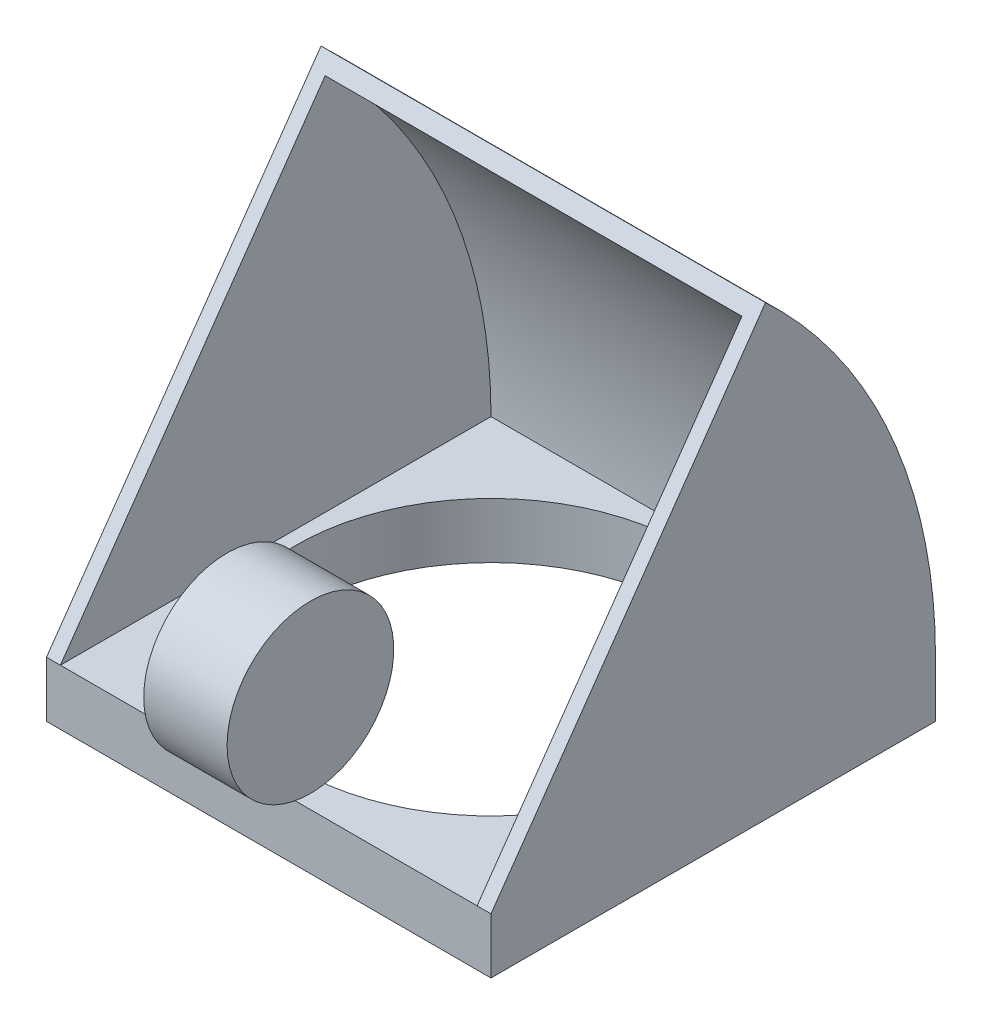
ISO-10303-21;
HEADER;
FILE_DESCRIPTION(('STEP AP214'),'2;1');
FILE_NAME('part.step','',(''),(''),'','','');
FILE_SCHEMA(('AUTOMOTIVE_DESIGN { 1 0 10303 214 1 1 1 1 }'));
ENDSEC;
DATA;
#1=APPLICATION_CONTEXT('core data for automotive mechanical design processes');
#2=APPLICATION_PROTOCOL_DEFINITION('international standard','automotive_design',2000,#1);
#3=PRODUCT_CONTEXT('',#1,'mechanical');
#4=PRODUCT('Part','Part','',(#3));
#5=PRODUCT_RELATED_PRODUCT_CATEGORY('part','',(#4));
#6=PRODUCT_DEFINITION_FORMATION('','',#4);
#7=PRODUCT_DEFINITION_CONTEXT('part definition',#1,'design');
#8=PRODUCT_DEFINITION('design','',#6,#7);
#9=PRODUCT_DEFINITION_SHAPE('','',#8);
#10=(LENGTH_UNIT() NAMED_UNIT(*) SI_UNIT(.MILLI.,.METRE.));
#11=(NAMED_UNIT(*) PLANE_ANGLE_UNIT() SI_UNIT($,.RADIAN.));
#12=(NAMED_UNIT(*) SI_UNIT($,.STERADIAN.) SOLID_ANGLE_UNIT());
#13=UNCERTAINTY_MEASURE_WITH_UNIT(LENGTH_MEASURE(1.E-05),#10,'distance_accuracy_value','');
#14=(GEOMETRIC_REPRESENTATION_CONTEXT(3) GLOBAL_UNCERTAINTY_ASSIGNED_CONTEXT((#13)) GLOBAL_UNIT_ASSIGNED_CONTEXT((#10,
#11,#12)) REPRESENTATION_CONTEXT('',''));
#15=CARTESIAN_POINT('',(0.,0.,0.));
#16=DIRECTION('',(0.,0.,1.));
#17=DIRECTION('',(1.,0.,0.));
#18=AXIS2_PLACEMENT_3D('',#15,#16,#17);
#19=CARTESIAN_POINT('',(19.05,69.85,101.6));
#20=DIRECTION('',(-1.,0.,0.));
#21=DIRECTION('',(0.,0.,1.));
#22=AXIS2_PLACEMENT_3D('',#19,#20,#21);
#23=CYLINDRICAL_SURFACE('',#22,38.1);
#24=CARTESIAN_POINT('',(19.05,69.85,101.6));
#25=DIRECTION('',(1.,0.,0.));
#26=DIRECTION('',(0.,0.,-1.));
#27=AXIS2_PLACEMENT_3D('',#24,#25,#26);
#28=CIRCLE('',#27,38.1);
#29=CARTESIAN_POINT('',(19.05,69.85,139.7));
#30=VERTEX_POINT('',#29);
#31=EDGE_CURVE('E11',#30,#30,#28,.T.);
#32=CARTESIAN_POINT('',(-19.05,69.85,101.6));
#33=DIRECTION('',(1.,0.,0.));
#34=DIRECTION('',(0.,0.,-1.));
#35=AXIS2_PLACEMENT_3D('',#32,#33,#34);
#36=CIRCLE('',#35,38.1);
#37=CARTESIAN_POINT('',(-19.05,69.85,139.7));
#38=VERTEX_POINT('',#37);
#39=EDGE_CURVE('E65',#38,#38,#36,.T.);
#40=CARTESIAN_POINT('',(19.05,69.85,139.7));
#41=CARTESIAN_POINT('',(18.653125,69.85,139.7));
#42=CARTESIAN_POINT('',(18.25625,69.85,139.7));
#43=CARTESIAN_POINT('',(17.4625,69.85,139.7));
#44=CARTESIAN_POINT('',(17.065625,69.85,139.7));
#45=CARTESIAN_POINT('',(16.271875,69.85,139.7));
#46=CARTESIAN_POINT('',(15.875,69.85,139.7));
#47=CARTESIAN_POINT('',(15.08125,69.85,139.7));
#48=CARTESIAN_POINT('',(14.684375,69.85,139.7));
#49=CARTESIAN_POINT('',(13.890625,69.85,139.7));
#50=CARTESIAN_POINT('',(13.49375,69.85,139.7));
#51=CARTESIAN_POINT('',(12.7,69.85,139.7));
#52=CARTESIAN_POINT('',(12.303125,69.85,139.7));
#53=CARTESIAN_POINT('',(11.509375,69.85,139.7));
#54=CARTESIAN_POINT('',(11.1125,69.85,139.7));
#55=CARTESIAN_POINT('',(10.31875,69.85,139.7));
#56=CARTESIAN_POINT('',(9.921875,69.85,139.7));
#57=CARTESIAN_POINT('',(9.128125,69.85,139.7));
#58=CARTESIAN_POINT('',(8.73125,69.85,139.7));
#59=CARTESIAN_POINT('',(7.9375,69.85,139.7));
#60=CARTESIAN_POINT('',(7.540625,69.85,139.7));
#61=CARTESIAN_POINT('',(6.746875,69.85,139.7));
#62=CARTESIAN_POINT('',(6.35,69.85,139.7));
#63=CARTESIAN_POINT('',(5.55625,69.85,139.7));
#64=CARTESIAN_POINT('',(5.159375,69.85,139.7));
#65=CARTESIAN_POINT('',(4.365625,69.85,139.7));
#66=CARTESIAN_POINT('',(3.96875,69.85,139.7));
#67=CARTESIAN_POINT('',(3.175,69.85,139.7));
#68=CARTESIAN_POINT('',(2.778125,69.85,139.7));
#69=CARTESIAN_POINT('',(1.984375,69.85,139.7));
#70=CARTESIAN_POINT('',(1.5875,69.85,139.7));
#71=CARTESIAN_POINT('',(0.79375,69.85,139.7));
#72=CARTESIAN_POINT('',(0.396875,69.85,139.7));
#73=CARTESIAN_POINT('',(-0.396875,69.85,139.7));
#74=CARTESIAN_POINT('',(-0.79375,69.85,139.7));
#75=CARTESIAN_POINT('',(-1.5875,69.85,139.7));
#76=CARTESIAN_POINT('',(-1.984375,69.85,139.7));
#77=CARTESIAN_POINT('',(-2.778125,69.85,139.7));
#78=CARTESIAN_POINT('',(-3.175,69.85,139.7));
#79=CARTESIAN_POINT('',(-3.96875,69.85,139.7));
#80=CARTESIAN_POINT('',(-4.365625,69.85,139.7));
#81=CARTESIAN_POINT('',(-5.159375,69.85,139.7));
#82=CARTESIAN_POINT('',(-5.55625,69.85,139.7));
#83=CARTESIAN_POINT('',(-6.35,69.85,139.7));
#84=CARTESIAN_POINT('',(-6.746875,69.85,139.7));
#85=CARTESIAN_POINT('',(-7.540625,69.85,139.7));
#86=CARTESIAN_POINT('',(-7.9375,69.85,139.7));
#87=CARTESIAN_POINT('',(-8.73125,69.85,139.7));
#88=CARTESIAN_POINT('',(-9.128125,69.85,139.7));
#89=CARTESIAN_POINT('',(-9.921875,69.85,139.7));
#90=CARTESIAN_POINT('',(-10.31875,69.85,139.7));
#91=CARTESIAN_POINT('',(-11.1125,69.85,139.7));
#92=CARTESIAN_POINT('',(-11.509375,69.85,139.7));
#93=CARTESIAN_POINT('',(-12.303125,69.85,139.7));
#94=CARTESIAN_POINT('',(-12.7,69.85,139.7));
#95=CARTESIAN_POINT('',(-13.49375,69.85,139.7));
#96=CARTESIAN_POINT('',(-13.890625,69.85,139.7));
#97=CARTESIAN_POINT('',(-14.684375,69.85,139.7));
#98=CARTESIAN_POINT('',(-15.08125,69.85,139.7));
#99=CARTESIAN_POINT('',(-15.875,69.85,139.7));
#100=CARTESIAN_POINT('',(-16.271875,69.85,139.7));
#101=CARTESIAN_POINT('',(-17.065625,69.85,139.7));
#102=CARTESIAN_POINT('',(-17.4625,69.85,139.7));
#103=CARTESIAN_POINT('',(-18.25625,69.85,139.7));
#104=CARTESIAN_POINT('',(-18.653125,69.85,139.7));
#105=CARTESIAN_POINT('',(-19.05,69.85,139.7));
#106=B_SPLINE_CURVE_WITH_KNOTS('',3,(#40,#41,#42,#43,#44,#45,#46,#47,#48,#49,#50,#51,#52,#53,
#54,#55,#56,#57,#58,#59,#60,#61,#62,#63,#64,#65,#66,#67,#68,#69,#70,#71,#72,#73,#74,#75,#76,#77,
#78,#79,#80,#81,#82,#83,#84,#85,#86,#87,#88,#89,#90,#91,#92,#93,#94,#95,#96,#97,#98,#99,#100,
#101,#102,#103,#104,#105),.UNSPECIFIED.,.F.,.F.,(4,2,2,2,2,2,2,2,2,2,2,2,2,2,2,2,2,2,2,2,2,2,2,
2,2,2,2,2,2,2,2,2,4),(0.,1.190625,2.38125,3.571875,4.7625,5.953125,7.14375,8.334375,9.525,
10.715625,11.90625,13.096875,14.2875,15.478125,16.66875,17.859375,19.05,20.240625,21.43125,
22.621875,23.8125,25.003125,26.19375,27.384375,28.575,29.765625,30.95625,32.146875,33.3375,
34.528125,35.71875,36.909375,38.1),.UNSPECIFIED.);
#107=EDGE_CURVE('BSEAM62',#30,#38,#106,.T.);
#108=ORIENTED_EDGE('',*,*,#31,.F.);
#109=ORIENTED_EDGE('',*,*,#39,.T.);
#110=ORIENTED_EDGE('',*,*,#107,.T.);
#111=ORIENTED_EDGE('',*,*,#107,.F.);
#112=EDGE_LOOP('',(#108,#110,#109,#111));
#113=FACE_BOUND('',#112,.T.);
#114=ADVANCED_FACE('F62',(#113),#23,.T.);
#115=CARTESIAN_POINT('',(19.05,0.,0.));
#116=DIRECTION('',(1.,0.,0.));
#117=DIRECTION('',(0.,0.,-1.));
#118=AXIS2_PLACEMENT_3D('',#115,#116,#117);
#119=PLANE('',#118);
#120=ORIENTED_EDGE('',*,*,#31,.T.);
#121=EDGE_LOOP('',(#120));
#122=FACE_BOUND('',#121,.T.);
#123=ADVANCED_FACE('F77',(#122),#119,.T.);
#124=CARTESIAN_POINT('',(-19.05,0.,0.));
#125=DIRECTION('',(1.,0.,0.));
#126=DIRECTION('',(0.,0.,-1.));
#127=AXIS2_PLACEMENT_3D('',#124,#125,#126);
#128=PLANE('',#127);
#129=ORIENTED_EDGE('',*,*,#39,.F.);
#130=EDGE_LOOP('',(#129));
#131=FACE_BOUND('',#130,.T.);
#132=ADVANCED_FACE('F75',(#131),#128,.F.);
#133=CLOSED_SHELL('',(#114,#123,#132));
#134=MANIFOLD_SOLID_BREP('B2',#133);
#135=CARTESIAN_POINT('',(0.,0.,0.));
#136=DIRECTION('',(0.,1.,0.));
#137=DIRECTION('',(0.,0.,1.));
#138=AXIS2_PLACEMENT_3D('',#135,#136,#137);
#139=PLANE('',#138);
#140=DIRECTION('',(0.,0.,-1.));
#141=VECTOR('',#140,1.);
#142=CARTESIAN_POINT('',(101.6,0.,-101.6));
#143=LINE('',#142,#141);
#144=CARTESIAN_POINT('',(101.6,0.,101.6));
#145=VERTEX_POINT('',#144);
#146=CARTESIAN_POINT('',(101.6,0.,-101.6));
#147=VERTEX_POINT('',#146);
#148=EDGE_CURVE('E268',#145,#147,#143,.T.);
#149=ORIENTED_EDGE('',*,*,#148,.F.);
#150=DIRECTION('',(1.,0.,0.));
#151=VECTOR('',#150,1.);
#152=CARTESIAN_POINT('',(-101.6,0.,101.6));
#153=LINE('',#152,#151);
#154=CARTESIAN_POINT('',(-101.6,0.,101.6));
#155=VERTEX_POINT('',#154);
#156=EDGE_CURVE('E173',#155,#145,#153,.T.);
#157=ORIENTED_EDGE('',*,*,#156,.F.);
#158=DIRECTION('',(0.,0.,1.));
#159=VECTOR('',#158,1.);
#160=CARTESIAN_POINT('',(-101.6,0.,-101.6));
#161=LINE('',#160,#159);
#162=CARTESIAN_POINT('',(-101.6,0.,-101.6));
#163=VERTEX_POINT('',#162);
#164=EDGE_CURVE('E283',#163,#155,#161,.T.);
#165=ORIENTED_EDGE('',*,*,#164,.F.);
#166=DIRECTION('',(-1.,0.,0.));
#167=VECTOR('',#166,1.);
#168=CARTESIAN_POINT('',(-101.6,0.,-101.6));
#169=LINE('',#168,#167);
#170=EDGE_CURVE('E280',#147,#163,#169,.T.);
#171=ORIENTED_EDGE('',*,*,#170,.F.);
#172=EDGE_LOOP('',(#149,#157,#165,#171));
#173=FACE_BOUND('',#172,.T.);
#174=CARTESIAN_POINT('',(0.,0.,0.));
#175=DIRECTION('',(0.,1.,0.));
#176=DIRECTION('',(0.,0.,1.));
#177=AXIS2_PLACEMENT_3D('',#174,#175,#176);
#178=CIRCLE('',#177,88.9);
#179=CARTESIAN_POINT('',(0.,0.,88.9));
#180=VERTEX_POINT('',#179);
#181=EDGE_CURVE('E261',#180,#180,#178,.T.);
#182=ORIENTED_EDGE('',*,*,#181,.T.);
#183=EDGE_LOOP('',(#182));
#184=FACE_BOUND('',#183,.T.);
#185=ADVANCED_FACE('F128',(#173,#184),#139,.F.);
#186=CARTESIAN_POINT('',(101.6,25.4,-101.6));
#187=DIRECTION('',(-1.,0.,0.));
#188=DIRECTION('',(0.,0.,1.));
#189=AXIS2_PLACEMENT_3D('',#186,#187,#188);
#190=PLANE('',#189);
#191=ORIENTED_EDGE('',*,*,#148,.T.);
#192=DIRECTION('',(0.,-1.,0.));
#193=VECTOR('',#192,1.);
#194=CARTESIAN_POINT('',(101.6,25.4,-101.6));
#195=LINE('',#194,#193);
#196=CARTESIAN_POINT('',(101.6,25.4,-101.6));
#197=VERTEX_POINT('',#196);
#198=EDGE_CURVE('E296',#197,#147,#195,.T.);
#199=ORIENTED_EDGE('',*,*,#198,.F.);
#200=CARTESIAN_POINT('',(101.6,25.4,143.933333333333));
#201=DIRECTION('',(1.,0.,0.));
#202=DIRECTION('',(0.,0.,-1.));
#203=AXIS2_PLACEMENT_3D('',#200,#201,#202);
#204=CIRCLE('',#203,245.533333333333);
#205=CARTESIAN_POINT('',(101.6,204.62292697686,-23.8932444892067));
#206=VERTEX_POINT('',#205);
#207=EDGE_CURVE('E248',#197,#206,#204,.T.);
#208=ORIENTED_EDGE('',*,*,#207,.T.);
#209=DIRECTION('',(0.,-0.819152044288989,0.57357643635105));
#210=VECTOR('',#209,1.);
#211=CARTESIAN_POINT('',(101.6,25.4,101.6));
#212=LINE('',#211,#210);
#213=CARTESIAN_POINT('',(101.6,25.4,101.6));
#214=VERTEX_POINT('',#213);
#215=EDGE_CURVE('E252',#206,#214,#212,.T.);
#216=ORIENTED_EDGE('',*,*,#215,.T.);
#217=DIRECTION('',(0.,-1.,0.));
#218=VECTOR('',#217,1.);
#219=CARTESIAN_POINT('',(101.6,25.4,101.6));
#220=LINE('',#219,#218);
#221=EDGE_CURVE('E276',#214,#145,#220,.T.);
#222=ORIENTED_EDGE('',*,*,#221,.T.);
#223=EDGE_LOOP('',(#191,#199,#208,#216,#222));
#224=FACE_BOUND('',#223,.T.);
#225=ADVANCED_FACE('F130',(#224),#190,.F.);
#226=CARTESIAN_POINT('',(-101.6,25.4,-101.6));
#227=DIRECTION('',(0.,0.,1.));
#228=DIRECTION('',(1.,0.,0.));
#229=AXIS2_PLACEMENT_3D('',#226,#227,#228);
#230=PLANE('',#229);
#231=ORIENTED_EDGE('',*,*,#170,.T.);
#232=DIRECTION('',(0.,-1.,0.));
#233=VECTOR('',#232,1.);
#234=CARTESIAN_POINT('',(-101.6,25.4,-101.6));
#235=LINE('',#234,#233);
#236=CARTESIAN_POINT('',(-101.6,25.4,-101.6));
#237=VERTEX_POINT('',#236);
#238=EDGE_CURVE('E292',#237,#163,#235,.T.);
#239=ORIENTED_EDGE('',*,*,#238,.F.);
#240=DIRECTION('',(-1.,0.,0.));
#241=VECTOR('',#240,1.);
#242=CARTESIAN_POINT('',(-101.6,25.4,-101.6));
#243=LINE('',#242,#241);
#244=EDGE_CURVE('E179',#197,#237,#243,.T.);
#245=ORIENTED_EDGE('',*,*,#244,.F.);
#246=ORIENTED_EDGE('',*,*,#198,.T.);
#247=EDGE_LOOP('',(#231,#239,#245,#246));
#248=FACE_BOUND('',#247,.T.);
#249=ADVANCED_FACE('F341',(#248),#230,.F.);
#250=CARTESIAN_POINT('',(-101.6,25.4,-101.6));
#251=DIRECTION('',(1.,0.,0.));
#252=DIRECTION('',(0.,0.,-1.));
#253=AXIS2_PLACEMENT_3D('',#250,#251,#252);
#254=PLANE('',#253);
#255=ORIENTED_EDGE('',*,*,#164,.T.);
#256=DIRECTION('',(0.,-1.,0.));
#257=VECTOR('',#256,1.);
#258=CARTESIAN_POINT('',(-101.6,25.4,101.6));
#259=LINE('',#258,#257);
#260=CARTESIAN_POINT('',(-101.6,25.4,101.6));
#261=VERTEX_POINT('',#260);
#262=EDGE_CURVE('E153',#261,#155,#259,.T.);
#263=ORIENTED_EDGE('',*,*,#262,.F.);
#264=DIRECTION('',(0.,0.819152044288989,-0.57357643635105));
#265=VECTOR('',#264,1.);
#266=CARTESIAN_POINT('',(-101.6,25.4,101.6));
#267=LINE('',#266,#265);
#268=CARTESIAN_POINT('',(-101.6,204.62292697686,-23.8932444892066));
#269=VERTEX_POINT('',#268);
#270=EDGE_CURVE('E243',#261,#269,#267,.T.);
#271=ORIENTED_EDGE('',*,*,#270,.T.);
#272=CARTESIAN_POINT('',(-101.6,25.4,143.933333333333));
#273=DIRECTION('',(1.,0.,0.));
#274=DIRECTION('',(0.,0.,-1.));
#275=AXIS2_PLACEMENT_3D('',#272,#273,#274);
#276=CIRCLE('',#275,245.533333333333);
#277=EDGE_CURVE('E246',#269,#237,#276,.F.);
#278=ORIENTED_EDGE('',*,*,#277,.T.);
#279=ORIENTED_EDGE('',*,*,#238,.T.);
#280=EDGE_LOOP('',(#255,#263,#271,#278,#279));
#281=FACE_BOUND('',#280,.T.);
#282=ADVANCED_FACE('F351',(#281),#254,.F.);
#283=CARTESIAN_POINT('',(-101.6,25.4,101.6));
#284=DIRECTION('',(0.,0.,-1.));
#285=DIRECTION('',(-1.,0.,0.));
#286=AXIS2_PLACEMENT_3D('',#283,#284,#285);
#287=PLANE('',#286);
#288=ORIENTED_EDGE('',*,*,#156,.T.);
#289=ORIENTED_EDGE('',*,*,#221,.F.);
#290=DIRECTION('',(1.,0.,0.));
#291=VECTOR('',#290,1.);
#292=CARTESIAN_POINT('',(-101.6,25.4,101.6));
#293=LINE('',#292,#291);
#294=CARTESIAN_POINT('',(95.25,25.4,101.6));
#295=VERTEX_POINT('',#294);
#296=EDGE_CURVE('E271',#295,#214,#293,.T.);
#297=ORIENTED_EDGE('',*,*,#296,.F.);
#298=DIRECTION('',(1.,0.,0.));
#299=VECTOR('',#298,1.);
#300=CARTESIAN_POINT('',(-95.25,25.4,101.6));
#301=LINE('',#300,#299);
#302=CARTESIAN_POINT('',(-95.25,25.4,101.6));
#303=VERTEX_POINT('',#302);
#304=EDGE_CURVE('E229',#303,#295,#301,.T.);
#305=ORIENTED_EDGE('',*,*,#304,.F.);
#306=EDGE_CURVE('E272',#261,#303,#293,.T.);
#307=ORIENTED_EDGE('',*,*,#306,.F.);
#308=ORIENTED_EDGE('',*,*,#262,.T.);
#309=EDGE_LOOP('',(#288,#289,#297,#305,#307,#308));
#310=FACE_BOUND('',#309,.T.);
#311=ADVANCED_FACE('F311',(#310),#287,.F.);
#312=CARTESIAN_POINT('',(0.,25.4,0.));
#313=DIRECTION('',(0.,-1.,0.));
#314=DIRECTION('',(0.,0.,-1.));
#315=AXIS2_PLACEMENT_3D('',#312,#313,#314);
#316=CYLINDRICAL_SURFACE('',#315,88.9);
#317=CARTESIAN_POINT('',(0.,25.4,0.));
#318=DIRECTION('',(0.,1.,0.));
#319=DIRECTION('',(0.,0.,1.));
#320=AXIS2_PLACEMENT_3D('',#317,#318,#319);
#321=CIRCLE('',#320,88.9);
#322=CARTESIAN_POINT('',(0.,25.4,88.9));
#323=VERTEX_POINT('',#322);
#324=EDGE_CURVE('E222',#323,#323,#321,.T.);
#325=ORIENTED_EDGE('',*,*,#324,.T.);
#326=EDGE_LOOP('',(#325));
#327=FACE_BOUND('',#326,.T.);
#328=ORIENTED_EDGE('',*,*,#181,.F.);
#329=EDGE_LOOP('',(#328));
#330=FACE_BOUND('',#329,.T.);
#331=ADVANCED_FACE('F347',(#327,#330),#316,.F.);
#332=CARTESIAN_POINT('',(-372.544823818712,25.4,101.6));
#333=DIRECTION('',(0.,0.57357643635105,0.819152044288989));
#334=DIRECTION('',(0.,-0.819152044288989,0.57357643635105));
#335=AXIS2_PLACEMENT_3D('',#332,#333,#334);
#336=PLANE('',#335);
#337=DIRECTION('',(0.,0.819152044288989,-0.57357643635105));
#338=VECTOR('',#337,1.);
#339=CARTESIAN_POINT('',(95.25,25.4,101.6));
#340=LINE('',#339,#338);
#341=CARTESIAN_POINT('',(95.25,198.27292697686,-19.446926621575));
#342=VERTEX_POINT('',#341);
#343=EDGE_CURVE('E60',#295,#342,#340,.T.);
#344=ORIENTED_EDGE('',*,*,#343,.F.);
#345=ORIENTED_EDGE('',*,*,#296,.T.);
#346=ORIENTED_EDGE('',*,*,#215,.F.);
#347=DIRECTION('',(1.,0.,0.));
#348=VECTOR('',#347,1.);
#349=CARTESIAN_POINT('',(-372.544823818712,204.62292697686,-23.8932444892066));
#350=LINE('',#349,#348);
#351=EDGE_CURVE('E247',#269,#206,#350,.T.);
#352=ORIENTED_EDGE('',*,*,#351,.F.);
#353=ORIENTED_EDGE('',*,*,#270,.F.);
#354=ORIENTED_EDGE('',*,*,#306,.T.);
#355=DIRECTION('',(0.,-0.819152044288989,0.57357643635105));
#356=VECTOR('',#355,1.);
#357=CARTESIAN_POINT('',(-95.25,25.4,101.6));
#358=LINE('',#357,#356);
#359=CARTESIAN_POINT('',(-95.25,198.27292697686,-19.4469266215749));
#360=VERTEX_POINT('',#359);
#361=EDGE_CURVE('E233',#360,#303,#358,.T.);
#362=ORIENTED_EDGE('',*,*,#361,.F.);
#363=DIRECTION('',(-1.,0.,0.));
#364=VECTOR('',#363,1.);
#365=CARTESIAN_POINT('',(-372.544823818712,198.27292697686,-19.4469266215749));
#366=LINE('',#365,#364);
#367=EDGE_CURVE('E137',#342,#360,#366,.T.);
#368=ORIENTED_EDGE('',*,*,#367,.F.);
#369=EDGE_LOOP('',(#344,#345,#346,#352,#353,#354,#362,#368));
#370=FACE_BOUND('',#369,.T.);
#371=ADVANCED_FACE('F308',(#370),#336,.T.);
#372=CARTESIAN_POINT('',(-372.544823818712,25.4,143.933333333333));
#373=DIRECTION('',(1.,0.,0.));
#374=DIRECTION('',(0.,0.,-1.));
#375=AXIS2_PLACEMENT_3D('',#372,#373,#374);
#376=CYLINDRICAL_SURFACE('',#375,245.533333333333);
#377=ORIENTED_EDGE('',*,*,#277,.F.);
#378=ORIENTED_EDGE('',*,*,#351,.T.);
#379=ORIENTED_EDGE('',*,*,#207,.F.);
#380=ORIENTED_EDGE('',*,*,#244,.T.);
#381=EDGE_LOOP('',(#377,#378,#379,#380));
#382=FACE_BOUND('',#381,.T.);
#383=ADVANCED_FACE('F332',(#382),#376,.T.);
#384=CARTESIAN_POINT('',(-95.25,25.4,-114.301));
#385=DIRECTION('',(0.,-1.,0.));
#386=DIRECTION('',(0.,0.,-1.));
#387=AXIS2_PLACEMENT_3D('',#384,#385,#386);
#388=PLANE('',#387);
#389=DIRECTION('',(0.,0.,1.));
#390=VECTOR('',#389,1.);
#391=CARTESIAN_POINT('',(-95.25,25.4,-114.301));
#392=LINE('',#391,#390);
#393=CARTESIAN_POINT('',(-95.25,25.4,-95.25));
#394=VERTEX_POINT('',#393);
#395=EDGE_CURVE('E216',#394,#303,#392,.T.);
#396=ORIENTED_EDGE('',*,*,#395,.T.);
#397=ORIENTED_EDGE('',*,*,#304,.T.);
#398=DIRECTION('',(0.,0.,1.));
#399=VECTOR('',#398,1.);
#400=CARTESIAN_POINT('',(95.25,25.4,-114.301));
#401=LINE('',#400,#399);
#402=CARTESIAN_POINT('',(95.25,25.4,-95.25));
#403=VERTEX_POINT('',#402);
#404=EDGE_CURVE('E218',#403,#295,#401,.T.);
#405=ORIENTED_EDGE('',*,*,#404,.F.);
#406=DIRECTION('',(1.,0.,0.));
#407=VECTOR('',#406,1.);
#408=CARTESIAN_POINT('',(-372.544823818712,25.4,-95.2499999999999));
#409=LINE('',#408,#407);
#410=EDGE_CURVE('E210',#394,#403,#409,.T.);
#411=ORIENTED_EDGE('',*,*,#410,.F.);
#412=EDGE_LOOP('',(#396,#397,#405,#411));
#413=FACE_BOUND('',#412,.T.);
#414=ORIENTED_EDGE('',*,*,#324,.F.);
#415=EDGE_LOOP('',(#414));
#416=FACE_BOUND('',#415,.T.);
#417=ADVANCED_FACE('F212',(#413,#416),#388,.F.);
#418=CARTESIAN_POINT('',(95.25,25.4,-114.301));
#419=DIRECTION('',(1.,0.,0.));
#420=DIRECTION('',(0.,0.,-1.));
#421=AXIS2_PLACEMENT_3D('',#418,#419,#420);
#422=PLANE('',#421);
#423=ORIENTED_EDGE('',*,*,#343,.T.);
#424=DIRECTION('',(0.,0.,1.));
#425=VECTOR('',#424,1.);
#426=CARTESIAN_POINT('',(95.25,198.27292697686,-114.301));
#427=LINE('',#426,#425);
#428=CARTESIAN_POINT('',(95.25,198.27292697686,-21.3652391435573));
#429=VERTEX_POINT('',#428);
#430=EDGE_CURVE('E238',#429,#342,#427,.T.);
#431=ORIENTED_EDGE('',*,*,#430,.F.);
#432=CARTESIAN_POINT('',(95.25,25.4,143.933333333333));
#433=DIRECTION('',(1.,0.,0.));
#434=DIRECTION('',(0.,0.,-1.));
#435=AXIS2_PLACEMENT_3D('',#432,#433,#434);
#436=CIRCLE('',#435,239.183333333333);
#437=EDGE_CURVE('E316',#403,#429,#436,.T.);
#438=ORIENTED_EDGE('',*,*,#437,.F.);
#439=ORIENTED_EDGE('',*,*,#404,.T.);
#440=EDGE_LOOP('',(#423,#431,#438,#439));
#441=FACE_BOUND('',#440,.T.);
#442=ADVANCED_FACE('F315',(#441),#422,.F.);
#443=CARTESIAN_POINT('',(-95.25,198.27292697686,-114.301));
#444=DIRECTION('',(0.,1.,0.));
#445=DIRECTION('',(0.,0.,1.));
#446=AXIS2_PLACEMENT_3D('',#443,#444,#445);
#447=PLANE('',#446);
#448=ORIENTED_EDGE('',*,*,#367,.T.);
#449=DIRECTION('',(0.,0.,1.));
#450=VECTOR('',#449,1.);
#451=CARTESIAN_POINT('',(-95.25,198.27292697686,-114.301));
#452=LINE('',#451,#450);
#453=CARTESIAN_POINT('',(-95.25,198.27292697686,-21.3652391435572));
#454=VERTEX_POINT('',#453);
#455=EDGE_CURVE('E144',#454,#360,#452,.T.);
#456=ORIENTED_EDGE('',*,*,#455,.F.);
#457=DIRECTION('',(1.,0.,0.));
#458=VECTOR('',#457,1.);
#459=CARTESIAN_POINT('',(-372.544823818712,198.27292697686,-21.3652391435572));
#460=LINE('',#459,#458);
#461=EDGE_CURVE('E227',#429,#454,#460,.F.);
#462=ORIENTED_EDGE('',*,*,#461,.F.);
#463=ORIENTED_EDGE('',*,*,#430,.T.);
#464=EDGE_LOOP('',(#448,#456,#462,#463));
#465=FACE_BOUND('',#464,.T.);
#466=ADVANCED_FACE('F304',(#465),#447,.F.);
#467=CARTESIAN_POINT('',(-95.25,25.4,-114.301));
#468=DIRECTION('',(-1.,0.,0.));
#469=DIRECTION('',(0.,0.,1.));
#470=AXIS2_PLACEMENT_3D('',#467,#468,#469);
#471=PLANE('',#470);
#472=ORIENTED_EDGE('',*,*,#361,.T.);
#473=ORIENTED_EDGE('',*,*,#395,.F.);
#474=CARTESIAN_POINT('',(-95.25,25.4,143.933333333333));
#475=DIRECTION('',(-1.,0.,0.));
#476=DIRECTION('',(0.,0.,1.));
#477=AXIS2_PLACEMENT_3D('',#474,#475,#476);
#478=CIRCLE('',#477,239.183333333333);
#479=EDGE_CURVE('E225',#454,#394,#478,.T.);
#480=ORIENTED_EDGE('',*,*,#479,.F.);
#481=ORIENTED_EDGE('',*,*,#455,.T.);
#482=EDGE_LOOP('',(#472,#473,#480,#481));
#483=FACE_BOUND('',#482,.T.);
#484=ADVANCED_FACE('F231',(#483),#471,.F.);
#485=CARTESIAN_POINT('',(-372.544823818712,25.4,143.933333333333));
#486=DIRECTION('',(1.,0.,0.));
#487=DIRECTION('',(0.,0.,-1.));
#488=AXIS2_PLACEMENT_3D('',#485,#486,#487);
#489=CYLINDRICAL_SURFACE('',#488,239.183333333333);
#490=ORIENTED_EDGE('',*,*,#479,.T.);
#491=ORIENTED_EDGE('',*,*,#410,.T.);
#492=ORIENTED_EDGE('',*,*,#437,.T.);
#493=ORIENTED_EDGE('',*,*,#461,.T.);
#494=EDGE_LOOP('',(#490,#491,#492,#493));
#495=FACE_BOUND('',#494,.T.);
#496=ADVANCED_FACE('F226',(#495),#489,.F.);
#497=CLOSED_SHELL('',(#185,#225,#249,#282,#311,#331,#371,#383,#417,#442,#466,#484,#496));
#498=MANIFOLD_SOLID_BREP('B6',#497);
#499=ADVANCED_BREP_SHAPE_REPRESENTATION('',(#18,#134,#498),#14);
#500=SHAPE_DEFINITION_REPRESENTATION(#9,#499);
ENDSEC;
END-ISO-10303-21;
